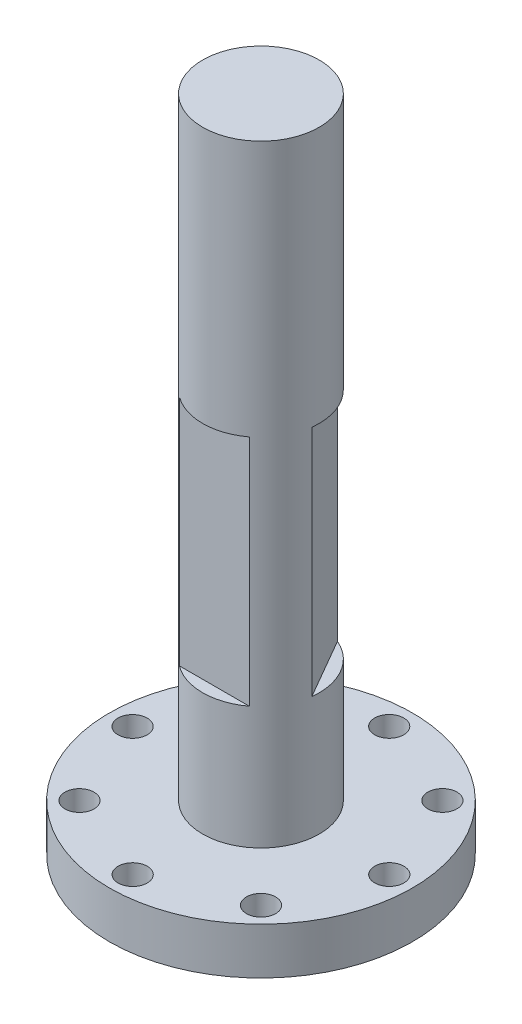
ISO-10303-21;
HEADER;
FILE_DESCRIPTION(('STEP AP214'),'2;1');
FILE_NAME('part.step','',(''),(''),'','','');
FILE_SCHEMA(('AUTOMOTIVE_DESIGN { 1 0 10303 214 1 1 1 1 }'));
ENDSEC;
DATA;
#1=APPLICATION_CONTEXT('core data for automotive mechanical design processes');
#2=APPLICATION_PROTOCOL_DEFINITION('international standard','automotive_design',2000,#1);
#3=PRODUCT_CONTEXT('',#1,'mechanical');
#4=PRODUCT('Part','Part','',(#3));
#5=PRODUCT_RELATED_PRODUCT_CATEGORY('part','',(#4));
#6=PRODUCT_DEFINITION_FORMATION('','',#4);
#7=PRODUCT_DEFINITION_CONTEXT('part definition',#1,'design');
#8=PRODUCT_DEFINITION('design','',#6,#7);
#9=PRODUCT_DEFINITION_SHAPE('','',#8);
#10=(LENGTH_UNIT() NAMED_UNIT(*) SI_UNIT(.MILLI.,.METRE.));
#11=(NAMED_UNIT(*) PLANE_ANGLE_UNIT() SI_UNIT($,.RADIAN.));
#12=(NAMED_UNIT(*) SI_UNIT($,.STERADIAN.) SOLID_ANGLE_UNIT());
#13=UNCERTAINTY_MEASURE_WITH_UNIT(LENGTH_MEASURE(1.E-05),#10,'distance_accuracy_value','');
#14=(GEOMETRIC_REPRESENTATION_CONTEXT(3) GLOBAL_UNCERTAINTY_ASSIGNED_CONTEXT((#13)) GLOBAL_UNIT_ASSIGNED_CONTEXT((#10,
#11,#12)) REPRESENTATION_CONTEXT('',''));
#15=CARTESIAN_POINT('',(0.,0.,0.));
#16=DIRECTION('',(0.,0.,1.));
#17=DIRECTION('',(1.,0.,0.));
#18=AXIS2_PLACEMENT_3D('',#15,#16,#17);
#19=CARTESIAN_POINT('',(0.,4.,0.));
#20=DIRECTION('',(0.,-1.,0.));
#21=DIRECTION('',(0.,0.,-1.));
#22=AXIS2_PLACEMENT_3D('',#19,#20,#21);
#23=CYLINDRICAL_SURFACE('',#22,13.);
#24=CARTESIAN_POINT('',(0.,4.,0.));
#25=DIRECTION('',(0.,1.,0.));
#26=DIRECTION('',(0.,0.,1.));
#27=AXIS2_PLACEMENT_3D('',#24,#25,#26);
#28=CIRCLE('',#27,13.);
#29=CARTESIAN_POINT('',(0.,4.,13.));
#30=VERTEX_POINT('',#29);
#31=EDGE_CURVE('E158',#30,#30,#28,.T.);
#32=ORIENTED_EDGE('',*,*,#31,.F.);
#33=EDGE_LOOP('',(#32));
#34=FACE_BOUND('',#33,.T.);
#35=CARTESIAN_POINT('',(0.,0.,0.));
#36=DIRECTION('',(0.,1.,0.));
#37=DIRECTION('',(0.,0.,1.));
#38=AXIS2_PLACEMENT_3D('',#35,#36,#37);
#39=CIRCLE('',#38,13.);
#40=CARTESIAN_POINT('',(0.,0.,13.));
#41=VERTEX_POINT('',#40);
#42=EDGE_CURVE('E154',#41,#41,#39,.T.);
#43=ORIENTED_EDGE('',*,*,#42,.T.);
#44=EDGE_LOOP('',(#43));
#45=FACE_BOUND('',#44,.T.);
#46=ADVANCED_FACE('F33',(#34,#45),#23,.T.);
#47=CARTESIAN_POINT('',(0.,4.,0.));
#48=DIRECTION('',(0.,1.,0.));
#49=DIRECTION('',(0.,0.,1.));
#50=AXIS2_PLACEMENT_3D('',#47,#48,#49);
#51=PLANE('',#50);
#52=CARTESIAN_POINT('',(0.,4.,-11.));
#53=DIRECTION('',(0.,1.,0.));
#54=DIRECTION('',(0.,0.,1.));
#55=AXIS2_PLACEMENT_3D('',#52,#53,#54);
#56=CIRCLE('',#55,1.25);
#57=CARTESIAN_POINT('',(0.,4.,-9.75));
#58=VERTEX_POINT('',#57);
#59=EDGE_CURVE('E104',#58,#58,#56,.T.);
#60=ORIENTED_EDGE('',*,*,#59,.F.);
#61=EDGE_LOOP('',(#60));
#62=FACE_BOUND('',#61,.T.);
#63=CARTESIAN_POINT('',(7.78187609896459,4.,-7.77970780700241));
#64=DIRECTION('',(0.,1.,0.));
#65=DIRECTION('',(0.,0.,1.));
#66=AXIS2_PLACEMENT_3D('',#63,#64,#65);
#67=CIRCLE('',#66,1.25);
#68=CARTESIAN_POINT('',(7.78187609896459,4.,-6.52970780700241));
#69=VERTEX_POINT('',#68);
#70=EDGE_CURVE('E112',#69,#69,#67,.T.);
#71=ORIENTED_EDGE('',*,*,#70,.F.);
#72=EDGE_LOOP('',(#71));
#73=FACE_BOUND('',#72,.T.);
#74=CARTESIAN_POINT('',(11.0074030118251,4.,-4.44561007201683E-13));
#75=DIRECTION('',(0.,1.,0.));
#76=DIRECTION('',(0.,0.,1.));
#77=AXIS2_PLACEMENT_3D('',#74,#75,#76);
#78=CIRCLE('',#77,1.25);
#79=CARTESIAN_POINT('',(11.0074030118251,4.,1.24999999999956));
#80=VERTEX_POINT('',#79);
#81=EDGE_CURVE('E118',#80,#80,#78,.T.);
#82=ORIENTED_EDGE('',*,*,#81,.F.);
#83=EDGE_LOOP('',(#82));
#84=FACE_BOUND('',#83,.T.);
#85=CARTESIAN_POINT('',(7.78711081882764,4.,7.78187609896387));
#86=DIRECTION('',(0.,1.,0.));
#87=DIRECTION('',(0.,0.,1.));
#88=AXIS2_PLACEMENT_3D('',#85,#86,#87);
#89=CIRCLE('',#88,1.25);
#90=CARTESIAN_POINT('',(7.78711081882764,4.,9.03187609896387));
#91=VERTEX_POINT('',#90);
#92=EDGE_CURVE('E124',#91,#91,#89,.T.);
#93=ORIENTED_EDGE('',*,*,#92,.F.);
#94=EDGE_LOOP('',(#93));
#95=FACE_BOUND('',#94,.T.);
#96=CARTESIAN_POINT('',(0.00740301182570634,4.,11.0074030118245));
#97=DIRECTION('',(0.,1.,0.));
#98=DIRECTION('',(0.,0.,1.));
#99=AXIS2_PLACEMENT_3D('',#96,#97,#98);
#100=CIRCLE('',#99,1.25);
#101=CARTESIAN_POINT('',(0.00740301182570634,4.,12.2574030118245));
#102=VERTEX_POINT('',#101);
#103=EDGE_CURVE('E130',#102,#102,#100,.T.);
#104=ORIENTED_EDGE('',*,*,#103,.F.);
#105=EDGE_LOOP('',(#104));
#106=FACE_BOUND('',#105,.T.);
#107=CARTESIAN_POINT('',(-7.77447308713875,4.,7.78711081882697));
#108=DIRECTION('',(0.,1.,0.));
#109=DIRECTION('',(0.,0.,1.));
#110=AXIS2_PLACEMENT_3D('',#107,#108,#109);
#111=CIRCLE('',#110,1.25);
#112=CARTESIAN_POINT('',(-7.77447308713875,4.,9.03711081882698));
#113=VERTEX_POINT('',#112);
#114=EDGE_CURVE('E136',#113,#113,#111,.T.);
#115=ORIENTED_EDGE('',*,*,#114,.F.);
#116=EDGE_LOOP('',(#115));
#117=FACE_BOUND('',#116,.T.);
#118=CARTESIAN_POINT('',(-10.9999999999994,4.,0.00740301182503112));
#119=DIRECTION('',(0.,1.,0.));
#120=DIRECTION('',(0.,0.,1.));
#121=AXIS2_PLACEMENT_3D('',#118,#119,#120);
#122=CIRCLE('',#121,1.25);
#123=CARTESIAN_POINT('',(-10.9999999999994,4.,1.25740301182503));
#124=VERTEX_POINT('',#123);
#125=EDGE_CURVE('E142',#124,#124,#122,.T.);
#126=ORIENTED_EDGE('',*,*,#125,.F.);
#127=EDGE_LOOP('',(#126));
#128=FACE_BOUND('',#127,.T.);
#129=CARTESIAN_POINT('',(-7.7797078070018,4.,-7.77447308713941));
#130=DIRECTION('',(0.,1.,0.));
#131=DIRECTION('',(0.,0.,1.));
#132=AXIS2_PLACEMENT_3D('',#129,#130,#131);
#133=CIRCLE('',#132,1.25);
#134=CARTESIAN_POINT('',(-7.7797078070018,4.,-6.52447308713941));
#135=VERTEX_POINT('',#134);
#136=EDGE_CURVE('E103',#135,#135,#133,.T.);
#137=ORIENTED_EDGE('',*,*,#136,.F.);
#138=EDGE_LOOP('',(#137));
#139=FACE_BOUND('',#138,.T.);
#140=CARTESIAN_POINT('',(0.,4.,0.));
#141=DIRECTION('',(0.,1.,0.));
#142=DIRECTION('',(0.,0.,1.));
#143=AXIS2_PLACEMENT_3D('',#140,#141,#142);
#144=CIRCLE('',#143,5.);
#145=CARTESIAN_POINT('',(0.,4.,5.));
#146=VERTEX_POINT('',#145);
#147=EDGE_CURVE('E155',#146,#146,#144,.T.);
#148=ORIENTED_EDGE('',*,*,#147,.F.);
#149=EDGE_LOOP('',(#148));
#150=FACE_BOUND('',#149,.T.);
#151=ORIENTED_EDGE('',*,*,#31,.T.);
#152=EDGE_LOOP('',(#151));
#153=FACE_BOUND('',#152,.T.);
#154=ADVANCED_FACE('F187',(#62,#73,#84,#95,#106,#117,#128,#139,#150,#153),#51,.T.);
#155=CARTESIAN_POINT('',(0.,0.,0.));
#156=DIRECTION('',(0.,1.,0.));
#157=DIRECTION('',(0.,0.,1.));
#158=AXIS2_PLACEMENT_3D('',#155,#156,#157);
#159=PLANE('',#158);
#160=CARTESIAN_POINT('',(0.,0.,0.));
#161=DIRECTION('',(0.,-1.,0.));
#162=DIRECTION('',(0.,0.,-1.));
#163=AXIS2_PLACEMENT_3D('',#160,#161,#162);
#164=CIRCLE('',#163,6.);
#165=CARTESIAN_POINT('',(0.,0.,-6.));
#166=VERTEX_POINT('',#165);
#167=EDGE_CURVE('E386',#166,#166,#164,.T.);
#168=ORIENTED_EDGE('',*,*,#167,.F.);
#169=EDGE_LOOP('',(#168));
#170=FACE_BOUND('',#169,.T.);
#171=CARTESIAN_POINT('',(0.,0.,-11.));
#172=DIRECTION('',(0.,1.,0.));
#173=DIRECTION('',(0.,0.,1.));
#174=AXIS2_PLACEMENT_3D('',#171,#172,#173);
#175=CIRCLE('',#174,1.25);
#176=CARTESIAN_POINT('',(0.,0.,-9.75));
#177=VERTEX_POINT('',#176);
#178=EDGE_CURVE('E107',#177,#177,#175,.F.);
#179=ORIENTED_EDGE('',*,*,#178,.F.);
#180=EDGE_LOOP('',(#179));
#181=FACE_BOUND('',#180,.T.);
#182=CARTESIAN_POINT('',(7.78187609896459,0.,-7.77970780700241));
#183=DIRECTION('',(0.,1.,0.));
#184=DIRECTION('',(0.,0.,1.));
#185=AXIS2_PLACEMENT_3D('',#182,#183,#184);
#186=CIRCLE('',#185,1.25);
#187=CARTESIAN_POINT('',(7.78187609896459,0.,-6.52970780700241));
#188=VERTEX_POINT('',#187);
#189=EDGE_CURVE('E108',#188,#188,#186,.F.);
#190=ORIENTED_EDGE('',*,*,#189,.F.);
#191=EDGE_LOOP('',(#190));
#192=FACE_BOUND('',#191,.T.);
#193=CARTESIAN_POINT('',(11.0074030118251,0.,-4.44561007201683E-13));
#194=DIRECTION('',(0.,1.,0.));
#195=DIRECTION('',(0.,0.,1.));
#196=AXIS2_PLACEMENT_3D('',#193,#194,#195);
#197=CIRCLE('',#196,1.25);
#198=CARTESIAN_POINT('',(11.0074030118251,0.,1.24999999999956));
#199=VERTEX_POINT('',#198);
#200=EDGE_CURVE('E115',#199,#199,#197,.F.);
#201=ORIENTED_EDGE('',*,*,#200,.F.);
#202=EDGE_LOOP('',(#201));
#203=FACE_BOUND('',#202,.T.);
#204=CARTESIAN_POINT('',(7.78711081882764,0.,7.78187609896387));
#205=DIRECTION('',(0.,1.,0.));
#206=DIRECTION('',(0.,0.,1.));
#207=AXIS2_PLACEMENT_3D('',#204,#205,#206);
#208=CIRCLE('',#207,1.25);
#209=CARTESIAN_POINT('',(7.78711081882764,0.,9.03187609896387));
#210=VERTEX_POINT('',#209);
#211=EDGE_CURVE('E121',#210,#210,#208,.F.);
#212=ORIENTED_EDGE('',*,*,#211,.F.);
#213=EDGE_LOOP('',(#212));
#214=FACE_BOUND('',#213,.T.);
#215=CARTESIAN_POINT('',(0.00740301182570634,0.,11.0074030118245));
#216=DIRECTION('',(0.,1.,0.));
#217=DIRECTION('',(0.,0.,1.));
#218=AXIS2_PLACEMENT_3D('',#215,#216,#217);
#219=CIRCLE('',#218,1.25);
#220=CARTESIAN_POINT('',(0.00740301182570634,0.,12.2574030118245));
#221=VERTEX_POINT('',#220);
#222=EDGE_CURVE('E127',#221,#221,#219,.F.);
#223=ORIENTED_EDGE('',*,*,#222,.F.);
#224=EDGE_LOOP('',(#223));
#225=FACE_BOUND('',#224,.T.);
#226=CARTESIAN_POINT('',(-7.77447308713875,0.,7.78711081882697));
#227=DIRECTION('',(0.,1.,0.));
#228=DIRECTION('',(0.,0.,1.));
#229=AXIS2_PLACEMENT_3D('',#226,#227,#228);
#230=CIRCLE('',#229,1.25);
#231=CARTESIAN_POINT('',(-7.77447308713875,0.,9.03711081882698));
#232=VERTEX_POINT('',#231);
#233=EDGE_CURVE('E133',#232,#232,#230,.F.);
#234=ORIENTED_EDGE('',*,*,#233,.F.);
#235=EDGE_LOOP('',(#234));
#236=FACE_BOUND('',#235,.T.);
#237=CARTESIAN_POINT('',(-10.9999999999994,0.,0.00740301182503112));
#238=DIRECTION('',(0.,1.,0.));
#239=DIRECTION('',(0.,0.,1.));
#240=AXIS2_PLACEMENT_3D('',#237,#238,#239);
#241=CIRCLE('',#240,1.25);
#242=CARTESIAN_POINT('',(-10.9999999999994,0.,1.25740301182503));
#243=VERTEX_POINT('',#242);
#244=EDGE_CURVE('E139',#243,#243,#241,.F.);
#245=ORIENTED_EDGE('',*,*,#244,.F.);
#246=EDGE_LOOP('',(#245));
#247=FACE_BOUND('',#246,.T.);
#248=CARTESIAN_POINT('',(-7.7797078070018,0.,-7.77447308713941));
#249=DIRECTION('',(0.,1.,0.));
#250=DIRECTION('',(0.,0.,1.));
#251=AXIS2_PLACEMENT_3D('',#248,#249,#250);
#252=CIRCLE('',#251,1.25);
#253=CARTESIAN_POINT('',(-7.7797078070018,0.,-6.52447308713941));
#254=VERTEX_POINT('',#253);
#255=EDGE_CURVE('E145',#254,#254,#252,.F.);
#256=ORIENTED_EDGE('',*,*,#255,.F.);
#257=EDGE_LOOP('',(#256));
#258=FACE_BOUND('',#257,.T.);
#259=ORIENTED_EDGE('',*,*,#42,.F.);
#260=EDGE_LOOP('',(#259));
#261=FACE_BOUND('',#260,.T.);
#262=ADVANCED_FACE('F192',(#170,#181,#192,#203,#214,#225,#236,#247,#258,#261),#159,.F.);
#263=CARTESIAN_POINT('',(0.,56.5,0.));
#264=DIRECTION('',(0.,-1.,0.));
#265=DIRECTION('',(0.,0.,-1.));
#266=AXIS2_PLACEMENT_3D('',#263,#264,#265);
#267=CYLINDRICAL_SURFACE('',#266,5.);
#268=DIRECTION('',(0.,-1.,0.));
#269=VECTOR('',#268,1.);
#270=CARTESIAN_POINT('',(4.96410161513776,34.5,0.598076211353329));
#271=LINE('',#270,#269);
#272=CARTESIAN_POINT('',(4.96410161513776,34.5,0.598076211353329));
#273=VERTEX_POINT('',#272);
#274=CARTESIAN_POINT('',(4.96410161513776,14.5,0.598076211353329));
#275=VERTEX_POINT('',#274);
#276=EDGE_CURVE('E80',#273,#275,#271,.T.);
#277=ORIENTED_EDGE('',*,*,#276,.F.);
#278=CARTESIAN_POINT('',(0.,34.5,0.));
#279=DIRECTION('',(0.,1.,0.));
#280=DIRECTION('',(0.,0.,1.));
#281=AXIS2_PLACEMENT_3D('',#278,#279,#280);
#282=CIRCLE('',#281,5.);
#283=CARTESIAN_POINT('',(1.96410161513777,34.5,-4.59807621135331));
#284=VERTEX_POINT('',#283);
#285=EDGE_CURVE('E11',#273,#284,#282,.T.);
#286=ORIENTED_EDGE('',*,*,#285,.T.);
#287=DIRECTION('',(0.,1.,0.));
#288=VECTOR('',#287,1.);
#289=CARTESIAN_POINT('',(1.96410161513777,34.5,-4.59807621135331));
#290=LINE('',#289,#288);
#291=CARTESIAN_POINT('',(1.96410161513777,14.5,-4.59807621135331));
#292=VERTEX_POINT('',#291);
#293=EDGE_CURVE('E81',#292,#284,#290,.T.);
#294=ORIENTED_EDGE('',*,*,#293,.F.);
#295=CARTESIAN_POINT('',(0.,14.5,0.));
#296=DIRECTION('',(0.,-1.,0.));
#297=DIRECTION('',(0.,0.,-1.));
#298=AXIS2_PLACEMENT_3D('',#295,#296,#297);
#299=CIRCLE('',#298,5.);
#300=EDGE_CURVE('E40',#292,#275,#299,.T.);
#301=ORIENTED_EDGE('',*,*,#300,.T.);
#302=EDGE_LOOP('',(#277,#286,#294,#301));
#303=FACE_BOUND('',#302,.T.);
#304=CARTESIAN_POINT('',(0.,34.5,0.));
#305=DIRECTION('',(0.,1.,0.));
#306=DIRECTION('',(0.,0.,1.));
#307=AXIS2_PLACEMENT_3D('',#304,#305,#306);
#308=CIRCLE('',#307,5.);
#309=CARTESIAN_POINT('',(-3.,34.5,4.));
#310=VERTEX_POINT('',#309);
#311=CARTESIAN_POINT('',(3.,34.5,4.));
#312=VERTEX_POINT('',#311);
#313=EDGE_CURVE('E164',#310,#312,#308,.T.);
#314=ORIENTED_EDGE('',*,*,#313,.T.);
#315=DIRECTION('',(0.,1.,0.));
#316=VECTOR('',#315,1.);
#317=CARTESIAN_POINT('',(3.,34.5,4.));
#318=LINE('',#317,#316);
#319=CARTESIAN_POINT('',(3.,14.5,4.));
#320=VERTEX_POINT('',#319);
#321=EDGE_CURVE('E97',#320,#312,#318,.T.);
#322=ORIENTED_EDGE('',*,*,#321,.F.);
#323=CARTESIAN_POINT('',(0.,14.5,0.));
#324=DIRECTION('',(0.,-1.,0.));
#325=DIRECTION('',(1.,0.,0.));
#326=AXIS2_PLACEMENT_3D('',#323,#324,#325);
#327=CIRCLE('',#326,5.);
#328=CARTESIAN_POINT('',(-3.,14.5,4.));
#329=VERTEX_POINT('',#328);
#330=EDGE_CURVE('E52',#320,#329,#327,.T.);
#331=ORIENTED_EDGE('',*,*,#330,.T.);
#332=DIRECTION('',(0.,-1.,0.));
#333=VECTOR('',#332,1.);
#334=CARTESIAN_POINT('',(-3.,34.5,4.));
#335=LINE('',#334,#333);
#336=EDGE_CURVE('E92',#310,#329,#335,.T.);
#337=ORIENTED_EDGE('',*,*,#336,.F.);
#338=EDGE_LOOP('',(#314,#322,#331,#337));
#339=FACE_BOUND('',#338,.T.);
#340=CARTESIAN_POINT('',(0.,56.5,0.));
#341=DIRECTION('',(0.,1.,0.));
#342=DIRECTION('',(0.,0.,1.));
#343=AXIS2_PLACEMENT_3D('',#340,#341,#342);
#344=CIRCLE('',#343,5.);
#345=CARTESIAN_POINT('',(0.,56.5,5.));
#346=VERTEX_POINT('',#345);
#347=EDGE_CURVE('E111',#346,#346,#344,.T.);
#348=ORIENTED_EDGE('',*,*,#347,.F.);
#349=EDGE_LOOP('',(#348));
#350=FACE_BOUND('',#349,.T.);
#351=ORIENTED_EDGE('',*,*,#147,.T.);
#352=EDGE_LOOP('',(#351));
#353=FACE_BOUND('',#352,.T.);
#354=ADVANCED_FACE('F84',(#303,#339,#350,#353),#267,.T.);
#355=CARTESIAN_POINT('',(0.,56.5,0.));
#356=DIRECTION('',(0.,1.,0.));
#357=DIRECTION('',(0.,0.,1.));
#358=AXIS2_PLACEMENT_3D('',#355,#356,#357);
#359=PLANE('',#358);
#360=ORIENTED_EDGE('',*,*,#347,.T.);
#361=EDGE_LOOP('',(#360));
#362=FACE_BOUND('',#361,.T.);
#363=ADVANCED_FACE('F204',(#362),#359,.T.);
#364=CARTESIAN_POINT('',(-7.7797078070018,-0.00100000000000013,-7.77447308713941));
#365=DIRECTION('',(0.,1.,0.));
#366=DIRECTION('',(0.,0.,1.));
#367=AXIS2_PLACEMENT_3D('',#364,#365,#366);
#368=CYLINDRICAL_SURFACE('',#367,1.25);
#369=ORIENTED_EDGE('',*,*,#136,.T.);
#370=EDGE_LOOP('',(#369));
#371=FACE_BOUND('',#370,.T.);
#372=ORIENTED_EDGE('',*,*,#255,.T.);
#373=EDGE_LOOP('',(#372));
#374=FACE_BOUND('',#373,.T.);
#375=ADVANCED_FACE('F211',(#371,#374),#368,.F.);
#376=CARTESIAN_POINT('',(-10.9999999999994,-0.00100000000000013,0.00740301182503112));
#377=DIRECTION('',(0.,1.,0.));
#378=DIRECTION('',(0.,0.,1.));
#379=AXIS2_PLACEMENT_3D('',#376,#377,#378);
#380=CYLINDRICAL_SURFACE('',#379,1.25);
#381=ORIENTED_EDGE('',*,*,#125,.T.);
#382=EDGE_LOOP('',(#381));
#383=FACE_BOUND('',#382,.T.);
#384=ORIENTED_EDGE('',*,*,#244,.T.);
#385=EDGE_LOOP('',(#384));
#386=FACE_BOUND('',#385,.T.);
#387=ADVANCED_FACE('F215',(#383,#386),#380,.F.);
#388=CARTESIAN_POINT('',(-7.77447308713875,-0.00100000000000013,7.78711081882697));
#389=DIRECTION('',(0.,1.,0.));
#390=DIRECTION('',(0.,0.,1.));
#391=AXIS2_PLACEMENT_3D('',#388,#389,#390);
#392=CYLINDRICAL_SURFACE('',#391,1.25);
#393=ORIENTED_EDGE('',*,*,#114,.T.);
#394=EDGE_LOOP('',(#393));
#395=FACE_BOUND('',#394,.T.);
#396=ORIENTED_EDGE('',*,*,#233,.T.);
#397=EDGE_LOOP('',(#396));
#398=FACE_BOUND('',#397,.T.);
#399=ADVANCED_FACE('F219',(#395,#398),#392,.F.);
#400=CARTESIAN_POINT('',(0.00740301182570634,-0.00100000000000013,11.0074030118245));
#401=DIRECTION('',(0.,1.,0.));
#402=DIRECTION('',(0.,0.,1.));
#403=AXIS2_PLACEMENT_3D('',#400,#401,#402);
#404=CYLINDRICAL_SURFACE('',#403,1.25);
#405=ORIENTED_EDGE('',*,*,#103,.T.);
#406=EDGE_LOOP('',(#405));
#407=FACE_BOUND('',#406,.T.);
#408=ORIENTED_EDGE('',*,*,#222,.T.);
#409=EDGE_LOOP('',(#408));
#410=FACE_BOUND('',#409,.T.);
#411=ADVANCED_FACE('F223',(#407,#410),#404,.F.);
#412=CARTESIAN_POINT('',(7.78711081882764,-0.00100000000000013,7.78187609896387));
#413=DIRECTION('',(0.,1.,0.));
#414=DIRECTION('',(0.,0.,1.));
#415=AXIS2_PLACEMENT_3D('',#412,#413,#414);
#416=CYLINDRICAL_SURFACE('',#415,1.25);
#417=ORIENTED_EDGE('',*,*,#92,.T.);
#418=EDGE_LOOP('',(#417));
#419=FACE_BOUND('',#418,.T.);
#420=ORIENTED_EDGE('',*,*,#211,.T.);
#421=EDGE_LOOP('',(#420));
#422=FACE_BOUND('',#421,.T.);
#423=ADVANCED_FACE('F227',(#419,#422),#416,.F.);
#424=CARTESIAN_POINT('',(11.0074030118251,-0.00100000000000013,-4.44561007201683E-13));
#425=DIRECTION('',(0.,1.,0.));
#426=DIRECTION('',(0.,0.,1.));
#427=AXIS2_PLACEMENT_3D('',#424,#425,#426);
#428=CYLINDRICAL_SURFACE('',#427,1.25);
#429=ORIENTED_EDGE('',*,*,#81,.T.);
#430=EDGE_LOOP('',(#429));
#431=FACE_BOUND('',#430,.T.);
#432=ORIENTED_EDGE('',*,*,#200,.T.);
#433=EDGE_LOOP('',(#432));
#434=FACE_BOUND('',#433,.T.);
#435=ADVANCED_FACE('F231',(#431,#434),#428,.F.);
#436=CARTESIAN_POINT('',(7.78187609896459,-0.00100000000000013,-7.77970780700241));
#437=DIRECTION('',(0.,1.,0.));
#438=DIRECTION('',(0.,0.,1.));
#439=AXIS2_PLACEMENT_3D('',#436,#437,#438);
#440=CYLINDRICAL_SURFACE('',#439,1.25);
#441=ORIENTED_EDGE('',*,*,#70,.T.);
#442=EDGE_LOOP('',(#441));
#443=FACE_BOUND('',#442,.T.);
#444=ORIENTED_EDGE('',*,*,#189,.T.);
#445=EDGE_LOOP('',(#444));
#446=FACE_BOUND('',#445,.T.);
#447=ADVANCED_FACE('F182',(#443,#446),#440,.F.);
#448=CARTESIAN_POINT('',(0.,-0.00100000000000013,-11.));
#449=DIRECTION('',(0.,1.,0.));
#450=DIRECTION('',(0.,0.,1.));
#451=AXIS2_PLACEMENT_3D('',#448,#449,#450);
#452=CYLINDRICAL_SURFACE('',#451,1.25);
#453=ORIENTED_EDGE('',*,*,#59,.T.);
#454=EDGE_LOOP('',(#453));
#455=FACE_BOUND('',#454,.T.);
#456=ORIENTED_EDGE('',*,*,#178,.T.);
#457=EDGE_LOOP('',(#456));
#458=FACE_BOUND('',#457,.T.);
#459=ADVANCED_FACE('F175',(#455,#458),#452,.F.);
#460=CARTESIAN_POINT('',(-3.,34.5,4.));
#461=DIRECTION('',(0.,1.,0.));
#462=DIRECTION('',(0.,0.,1.));
#463=AXIS2_PLACEMENT_3D('',#460,#461,#462);
#464=PLANE('',#463);
#465=ORIENTED_EDGE('',*,*,#313,.F.);
#466=DIRECTION('',(-1.,0.,0.));
#467=VECTOR('',#466,1.);
#468=CARTESIAN_POINT('',(-3.,34.5,4.));
#469=LINE('',#468,#467);
#470=EDGE_CURVE('E100',#312,#310,#469,.T.);
#471=ORIENTED_EDGE('',*,*,#470,.F.);
#472=EDGE_LOOP('',(#465,#471));
#473=FACE_BOUND('',#472,.T.);
#474=ADVANCED_FACE('F172',(#473),#464,.F.);
#475=CARTESIAN_POINT('',(-3.,14.5,4.));
#476=DIRECTION('',(0.,-1.,0.));
#477=DIRECTION('',(1.,0.,0.));
#478=AXIS2_PLACEMENT_3D('',#475,#476,#477);
#479=PLANE('',#478);
#480=DIRECTION('',(1.,0.,0.));
#481=VECTOR('',#480,1.);
#482=CARTESIAN_POINT('',(-3.,14.5,4.));
#483=LINE('',#482,#481);
#484=EDGE_CURVE('E95',#329,#320,#483,.T.);
#485=ORIENTED_EDGE('',*,*,#484,.F.);
#486=ORIENTED_EDGE('',*,*,#330,.F.);
#487=EDGE_LOOP('',(#485,#486));
#488=FACE_BOUND('',#487,.T.);
#489=ADVANCED_FACE('F174',(#488),#479,.F.);
#490=CARTESIAN_POINT('',(0.,0.,4.));
#491=DIRECTION('',(0.,0.,1.));
#492=DIRECTION('',(1.,0.,0.));
#493=AXIS2_PLACEMENT_3D('',#490,#491,#492);
#494=PLANE('',#493);
#495=ORIENTED_EDGE('',*,*,#336,.T.);
#496=ORIENTED_EDGE('',*,*,#484,.T.);
#497=ORIENTED_EDGE('',*,*,#321,.T.);
#498=ORIENTED_EDGE('',*,*,#470,.T.);
#499=EDGE_LOOP('',(#495,#496,#497,#498));
#500=FACE_BOUND('',#499,.T.);
#501=ADVANCED_FACE('F171',(#500),#494,.T.);
#502=CARTESIAN_POINT('',(1.96410161513777,34.5,-4.59807621135331));
#503=DIRECTION('',(0.,1.,0.));
#504=DIRECTION('',(0.,0.,1.));
#505=AXIS2_PLACEMENT_3D('',#502,#503,#504);
#506=PLANE('',#505);
#507=DIRECTION('',(0.499999999999998,0.,0.86602540378444));
#508=VECTOR('',#507,1.);
#509=CARTESIAN_POINT('',(1.96410161513777,34.5,-4.59807621135331));
#510=LINE('',#509,#508);
#511=EDGE_CURVE('E72',#284,#273,#510,.T.);
#512=ORIENTED_EDGE('',*,*,#511,.F.);
#513=ORIENTED_EDGE('',*,*,#285,.F.);
#514=EDGE_LOOP('',(#512,#513));
#515=FACE_BOUND('',#514,.T.);
#516=ADVANCED_FACE('F71',(#515),#506,.F.);
#517=CARTESIAN_POINT('',(1.96410161513777,14.5,-4.59807621135331));
#518=DIRECTION('',(0.,-1.,0.));
#519=DIRECTION('',(0.,0.,-1.));
#520=AXIS2_PLACEMENT_3D('',#517,#518,#519);
#521=PLANE('',#520);
#522=DIRECTION('',(-0.499999999999998,0.,-0.86602540378444));
#523=VECTOR('',#522,1.);
#524=CARTESIAN_POINT('',(1.96410161513777,14.5,-4.59807621135331));
#525=LINE('',#524,#523);
#526=EDGE_CURVE('E86',#275,#292,#525,.T.);
#527=ORIENTED_EDGE('',*,*,#526,.F.);
#528=ORIENTED_EDGE('',*,*,#300,.F.);
#529=EDGE_LOOP('',(#527,#528));
#530=FACE_BOUND('',#529,.T.);
#531=ADVANCED_FACE('F319',(#530),#521,.F.);
#532=CARTESIAN_POINT('',(3.46410161513776,0.,-1.99999999999999));
#533=DIRECTION('',(0.86602540378444,0.,-0.499999999999998));
#534=DIRECTION('',(-0.499999999999998,0.,-0.86602540378444));
#535=AXIS2_PLACEMENT_3D('',#532,#533,#534);
#536=PLANE('',#535);
#537=ORIENTED_EDGE('',*,*,#511,.T.);
#538=ORIENTED_EDGE('',*,*,#276,.T.);
#539=ORIENTED_EDGE('',*,*,#526,.T.);
#540=ORIENTED_EDGE('',*,*,#293,.T.);
#541=EDGE_LOOP('',(#537,#538,#539,#540));
#542=FACE_BOUND('',#541,.T.);
#543=ADVANCED_FACE('F79',(#542),#536,.T.);
#544=CARTESIAN_POINT('',(0.,3.,0.));
#545=DIRECTION('',(0.,-1.,0.));
#546=DIRECTION('',(0.,0.,-1.));
#547=AXIS2_PLACEMENT_3D('',#544,#545,#546);
#548=CYLINDRICAL_SURFACE('',#547,6.);
#549=CARTESIAN_POINT('',(0.,3.,0.));
#550=DIRECTION('',(0.,-1.,0.));
#551=DIRECTION('',(0.,0.,-1.));
#552=AXIS2_PLACEMENT_3D('',#549,#550,#551);
#553=CIRCLE('',#552,6.);
#554=CARTESIAN_POINT('',(0.,3.,-6.));
#555=VERTEX_POINT('',#554);
#556=EDGE_CURVE('E82',#555,#555,#553,.T.);
#557=ORIENTED_EDGE('',*,*,#556,.F.);
#558=EDGE_LOOP('',(#557));
#559=FACE_BOUND('',#558,.T.);
#560=ORIENTED_EDGE('',*,*,#167,.T.);
#561=EDGE_LOOP('',(#560));
#562=FACE_BOUND('',#561,.T.);
#563=ADVANCED_FACE('F335',(#559,#562),#548,.F.);
#564=CARTESIAN_POINT('',(0.,3.,0.));
#565=DIRECTION('',(0.,-1.,0.));
#566=DIRECTION('',(0.,0.,-1.));
#567=AXIS2_PLACEMENT_3D('',#564,#565,#566);
#568=PLANE('',#567);
#569=CARTESIAN_POINT('',(0.,3.,0.));
#570=DIRECTION('',(0.,-1.,0.));
#571=DIRECTION('',(0.,0.,-1.));
#572=AXIS2_PLACEMENT_3D('',#569,#570,#571);
#573=CIRCLE('',#572,3.);
#574=CARTESIAN_POINT('',(0.,3.,-3.));
#575=VERTEX_POINT('',#574);
#576=EDGE_CURVE('E387',#575,#575,#573,.T.);
#577=ORIENTED_EDGE('',*,*,#576,.F.);
#578=EDGE_LOOP('',(#577));
#579=FACE_BOUND('',#578,.T.);
#580=ORIENTED_EDGE('',*,*,#556,.T.);
#581=EDGE_LOOP('',(#580));
#582=FACE_BOUND('',#581,.T.);
#583=ADVANCED_FACE('F349',(#579,#582),#568,.T.);
#584=CARTESIAN_POINT('',(0.,8.,0.));
#585=DIRECTION('',(0.,-1.,0.));
#586=DIRECTION('',(0.,0.,-1.));
#587=AXIS2_PLACEMENT_3D('',#584,#585,#586);
#588=CYLINDRICAL_SURFACE('',#587,3.);
#589=CARTESIAN_POINT('',(0.,8.,0.));
#590=DIRECTION('',(0.,-1.,0.));
#591=DIRECTION('',(0.,0.,-1.));
#592=AXIS2_PLACEMENT_3D('',#589,#590,#591);
#593=CIRCLE('',#592,3.);
#594=CARTESIAN_POINT('',(0.,8.,-3.));
#595=VERTEX_POINT('',#594);
#596=EDGE_CURVE('E385',#595,#595,#593,.T.);
#597=ORIENTED_EDGE('',*,*,#596,.F.);
#598=EDGE_LOOP('',(#597));
#599=FACE_BOUND('',#598,.T.);
#600=ORIENTED_EDGE('',*,*,#576,.T.);
#601=EDGE_LOOP('',(#600));
#602=FACE_BOUND('',#601,.T.);
#603=ADVANCED_FACE('F359',(#599,#602),#588,.F.);
#604=CARTESIAN_POINT('',(0.,8.,0.));
#605=DIRECTION('',(0.,-1.,0.));
#606=DIRECTION('',(0.,0.,-1.));
#607=AXIS2_PLACEMENT_3D('',#604,#605,#606);
#608=PLANE('',#607);
#609=ORIENTED_EDGE('',*,*,#596,.T.);
#610=EDGE_LOOP('',(#609));
#611=FACE_BOUND('',#610,.T.);
#612=ADVANCED_FACE('F369',(#611),#608,.T.);
#613=CLOSED_SHELL('',(#46,#154,#262,#354,#363,#375,#387,#399,#411,#423,#435,#447,#459,#474,#489,
#501,#516,#531,#543,#563,#583,#603,#612));
#614=MANIFOLD_SOLID_BREP('B2',#613);
#615=ADVANCED_BREP_SHAPE_REPRESENTATION('',(#18,#614),#14);
#616=SHAPE_DEFINITION_REPRESENTATION(#9,#615);
ENDSEC;
END-ISO-10303-21;
